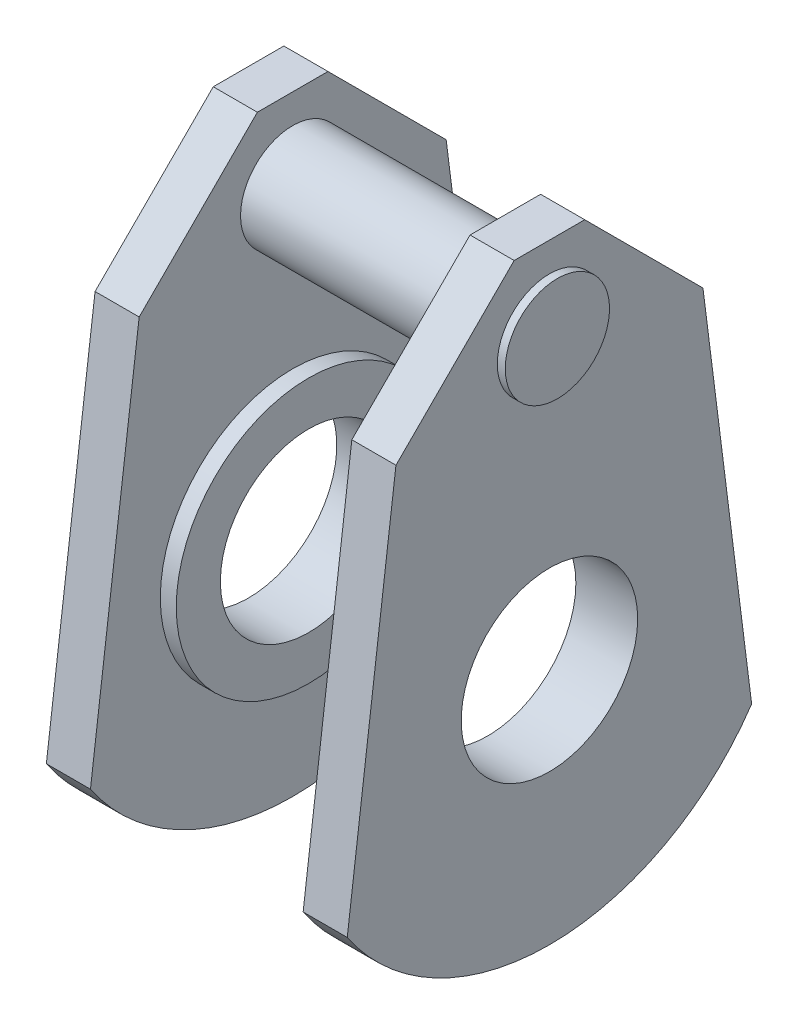
ISO-10303-21;
HEADER;
FILE_DESCRIPTION(('STEP AP214'),'2;1');
FILE_NAME('part.step','',(''),(''),'','','');
FILE_SCHEMA(('AUTOMOTIVE_DESIGN { 1 0 10303 214 1 1 1 1 }'));
ENDSEC;
DATA;
#1=APPLICATION_CONTEXT('core data for automotive mechanical design processes');
#2=APPLICATION_PROTOCOL_DEFINITION('international standard','automotive_design',2000,#1);
#3=PRODUCT_CONTEXT('',#1,'mechanical');
#4=PRODUCT('Part','Part','',(#3));
#5=PRODUCT_RELATED_PRODUCT_CATEGORY('part','',(#4));
#6=PRODUCT_DEFINITION_FORMATION('','',#4);
#7=PRODUCT_DEFINITION_CONTEXT('part definition',#1,'design');
#8=PRODUCT_DEFINITION('design','',#6,#7);
#9=PRODUCT_DEFINITION_SHAPE('','',#8);
#10=(LENGTH_UNIT() NAMED_UNIT(*) SI_UNIT(.MILLI.,.METRE.));
#11=(NAMED_UNIT(*) PLANE_ANGLE_UNIT() SI_UNIT($,.RADIAN.));
#12=(NAMED_UNIT(*) SI_UNIT($,.STERADIAN.) SOLID_ANGLE_UNIT());
#13=UNCERTAINTY_MEASURE_WITH_UNIT(LENGTH_MEASURE(1.E-05),#10,'distance_accuracy_value','');
#14=(GEOMETRIC_REPRESENTATION_CONTEXT(3) GLOBAL_UNCERTAINTY_ASSIGNED_CONTEXT((#13)) GLOBAL_UNIT_ASSIGNED_CONTEXT((#10,
#11,#12)) REPRESENTATION_CONTEXT('',''));
#15=CARTESIAN_POINT('',(0.,0.,0.));
#16=DIRECTION('',(0.,0.,1.));
#17=DIRECTION('',(1.,0.,0.));
#18=AXIS2_PLACEMENT_3D('',#15,#16,#17);
#19=CARTESIAN_POINT('',(12.05,0.,0.));
#20=DIRECTION('',(-1.,0.,0.));
#21=DIRECTION('',(0.,0.,1.));
#22=AXIS2_PLACEMENT_3D('',#19,#20,#21);
#23=CYLINDRICAL_SURFACE('',#22,15.);
#24=CARTESIAN_POINT('',(-10.2435826136185,0.,0.));
#25=DIRECTION('',(-1.,0.,0.));
#26=DIRECTION('',(0.,0.,1.));
#27=AXIS2_PLACEMENT_3D('',#24,#25,#26);
#28=CIRCLE('',#27,15.);
#29=CARTESIAN_POINT('',(-10.2435826136185,0.,15.));
#30=VERTEX_POINT('',#29);
#31=EDGE_CURVE('E206',#30,#30,#28,.T.);
#32=ORIENTED_EDGE('',*,*,#31,.T.);
#33=EDGE_LOOP('',(#32));
#34=FACE_BOUND('',#33,.T.);
#35=CARTESIAN_POINT('',(-12.05,0.,0.));
#36=DIRECTION('',(-1.,0.,0.));
#37=DIRECTION('',(0.,0.,1.));
#38=AXIS2_PLACEMENT_3D('',#35,#36,#37);
#39=CIRCLE('',#38,15.);
#40=CARTESIAN_POINT('',(-12.05,0.,15.));
#41=VERTEX_POINT('',#40);
#42=EDGE_CURVE('E184',#41,#41,#39,.T.);
#43=ORIENTED_EDGE('',*,*,#42,.F.);
#44=EDGE_LOOP('',(#43));
#45=FACE_BOUND('',#44,.T.);
#46=ADVANCED_FACE('F51',(#34,#45),#23,.T.);
#47=CARTESIAN_POINT('',(12.05,0.,0.));
#48=DIRECTION('',(-1.,0.,0.));
#49=DIRECTION('',(0.,0.,1.));
#50=AXIS2_PLACEMENT_3D('',#47,#48,#49);
#51=CYLINDRICAL_SURFACE('',#50,10.);
#52=CARTESIAN_POINT('',(-10.2435826136185,0.,0.));
#53=DIRECTION('',(-1.,0.,0.));
#54=DIRECTION('',(0.,0.,1.));
#55=AXIS2_PLACEMENT_3D('',#52,#53,#54);
#56=CIRCLE('',#55,10.);
#57=CARTESIAN_POINT('',(-10.2435826136185,0.,10.));
#58=VERTEX_POINT('',#57);
#59=EDGE_CURVE('E55',#58,#58,#56,.T.);
#60=ORIENTED_EDGE('',*,*,#59,.F.);
#61=EDGE_LOOP('',(#60));
#62=FACE_BOUND('',#61,.T.);
#63=CARTESIAN_POINT('',(-17.05,0.,0.));
#64=DIRECTION('',(-1.,0.,0.));
#65=DIRECTION('',(0.,0.,1.));
#66=AXIS2_PLACEMENT_3D('',#63,#64,#65);
#67=CIRCLE('',#66,10.);
#68=CARTESIAN_POINT('',(-17.05,0.,10.));
#69=VERTEX_POINT('',#68);
#70=EDGE_CURVE('E296',#69,#69,#67,.T.);
#71=ORIENTED_EDGE('',*,*,#70,.T.);
#72=EDGE_LOOP('',(#71));
#73=FACE_BOUND('',#72,.T.);
#74=ADVANCED_FACE('F332',(#62,#73),#51,.F.);
#75=CARTESIAN_POINT('',(10.0426560530877,0.,0.));
#76=DIRECTION('',(1.,0.,0.));
#77=DIRECTION('',(0.,0.,-1.));
#78=AXIS2_PLACEMENT_3D('',#75,#76,#77);
#79=CIRCLE('',#78,15.);
#80=CARTESIAN_POINT('',(10.0426560530877,0.,-15.));
#81=VERTEX_POINT('',#80);
#82=EDGE_CURVE('E196',#81,#81,#79,.T.);
#83=ORIENTED_EDGE('',*,*,#82,.T.);
#84=EDGE_LOOP('',(#83));
#85=FACE_BOUND('',#84,.T.);
#86=CARTESIAN_POINT('',(12.05,0.,0.));
#87=DIRECTION('',(1.,0.,0.));
#88=DIRECTION('',(0.,0.,-1.));
#89=AXIS2_PLACEMENT_3D('',#86,#87,#88);
#90=CIRCLE('',#89,15.);
#91=CARTESIAN_POINT('',(12.05,0.,-15.));
#92=VERTEX_POINT('',#91);
#93=EDGE_CURVE('E180',#92,#92,#90,.T.);
#94=ORIENTED_EDGE('',*,*,#93,.F.);
#95=EDGE_LOOP('',(#94));
#96=FACE_BOUND('',#95,.T.);
#97=ADVANCED_FACE('F53',(#85,#96),#23,.T.);
#98=CARTESIAN_POINT('',(10.0426560530877,0.,0.));
#99=DIRECTION('',(1.,0.,0.));
#100=DIRECTION('',(0.,0.,-1.));
#101=AXIS2_PLACEMENT_3D('',#98,#99,#100);
#102=CIRCLE('',#101,10.);
#103=CARTESIAN_POINT('',(10.0426560530877,0.,-10.));
#104=VERTEX_POINT('',#103);
#105=EDGE_CURVE('E193',#104,#104,#102,.T.);
#106=ORIENTED_EDGE('',*,*,#105,.F.);
#107=EDGE_LOOP('',(#106));
#108=FACE_BOUND('',#107,.T.);
#109=CARTESIAN_POINT('',(17.05,0.,0.));
#110=DIRECTION('',(1.,0.,0.));
#111=DIRECTION('',(0.,0.,-1.));
#112=AXIS2_PLACEMENT_3D('',#109,#110,#111);
#113=CIRCLE('',#112,10.);
#114=CARTESIAN_POINT('',(17.05,0.,-10.));
#115=VERTEX_POINT('',#114);
#116=EDGE_CURVE('E154',#115,#115,#113,.T.);
#117=ORIENTED_EDGE('',*,*,#116,.T.);
#118=EDGE_LOOP('',(#117));
#119=FACE_BOUND('',#118,.T.);
#120=ADVANCED_FACE('F339',(#108,#119),#51,.F.);
#121=CARTESIAN_POINT('',(17.05,0.647332808915461,0.));
#122=DIRECTION('',(1.,0.,0.));
#123=DIRECTION('',(0.,0.,-1.));
#124=AXIS2_PLACEMENT_3D('',#121,#122,#123);
#125=PLANE('',#124);
#126=CARTESIAN_POINT('',(17.05,32.9574193594756,0.));
#127=DIRECTION('',(1.,0.,0.));
#128=DIRECTION('',(0.,0.,-1.));
#129=AXIS2_PLACEMENT_3D('',#126,#127,#128);
#130=CIRCLE('',#129,5.90701498138917);
#131=CARTESIAN_POINT('',(17.05,32.9574193594756,-5.90701498138917));
#132=VERTEX_POINT('',#131);
#133=EDGE_CURVE('E12',#132,#132,#130,.T.);
#134=ORIENTED_EDGE('',*,*,#133,.F.);
#135=EDGE_LOOP('',(#134));
#136=FACE_BOUND('',#135,.T.);
#137=DIRECTION('',(0.,0.707106781186554,0.707106781186541));
#138=VECTOR('',#137,1.);
#139=CARTESIAN_POINT('',(17.05,42.1768709505272,-4.));
#140=LINE('',#139,#138);
#141=CARTESIAN_POINT('',(17.05,28.7813158914375,-17.3955550590895));
#142=VERTEX_POINT('',#141);
#143=CARTESIAN_POINT('',(17.05,42.1768709505272,-4.));
#144=VERTEX_POINT('',#143);
#145=EDGE_CURVE('E166',#142,#144,#140,.T.);
#146=ORIENTED_EDGE('',*,*,#145,.T.);
#147=DIRECTION('',(0.,0.,1.));
#148=VECTOR('',#147,1.);
#149=CARTESIAN_POINT('',(17.05,42.1768709505272,4.));
#150=LINE('',#149,#148);
#151=CARTESIAN_POINT('',(17.05,42.1768709505272,4.));
#152=VERTEX_POINT('',#151);
#153=EDGE_CURVE('E110',#144,#152,#150,.T.);
#154=ORIENTED_EDGE('',*,*,#153,.T.);
#155=DIRECTION('',(0.,-0.707106781186554,0.707106781186541));
#156=VECTOR('',#155,1.);
#157=CARTESIAN_POINT('',(17.05,42.1768709505272,4.));
#158=LINE('',#157,#156);
#159=CARTESIAN_POINT('',(17.05,28.7813158914375,17.3955550590895));
#160=VERTEX_POINT('',#159);
#161=EDGE_CURVE('E127',#152,#160,#158,.T.);
#162=ORIENTED_EDGE('',*,*,#161,.T.);
#163=DIRECTION('',(0.,-0.992078684734191,0.125618005461308));
#164=VECTOR('',#163,1.);
#165=CARTESIAN_POINT('',(17.05,28.7813158914375,17.3955550590895));
#166=LINE('',#165,#164);
#167=CARTESIAN_POINT('',(17.05,-14.8052566903872,22.9145309194471));
#168=VERTEX_POINT('',#167);
#169=EDGE_CURVE('E120',#160,#168,#166,.T.);
#170=ORIENTED_EDGE('',*,*,#169,.T.);
#171=CARTESIAN_POINT('',(17.05,0.647332808915461,0.));
#172=DIRECTION('',(1.,0.,0.));
#173=DIRECTION('',(0.,0.,-1.));
#174=AXIS2_PLACEMENT_3D('',#171,#172,#173);
#175=CIRCLE('',#174,27.6379856265296);
#176=CARTESIAN_POINT('',(17.05,-14.8052566903872,-22.9145309194471));
#177=VERTEX_POINT('',#176);
#178=EDGE_CURVE('E125',#168,#177,#175,.T.);
#179=ORIENTED_EDGE('',*,*,#178,.T.);
#180=DIRECTION('',(0.,0.992078684734191,0.125618005461308));
#181=VECTOR('',#180,1.);
#182=CARTESIAN_POINT('',(17.05,28.7813158914375,-17.3955550590895));
#183=LINE('',#182,#181);
#184=EDGE_CURVE('E71',#177,#142,#183,.T.);
#185=ORIENTED_EDGE('',*,*,#184,.T.);
#186=EDGE_LOOP('',(#146,#154,#162,#170,#179,#185));
#187=FACE_BOUND('',#186,.T.);
#188=ORIENTED_EDGE('',*,*,#116,.F.);
#189=EDGE_LOOP('',(#188));
#190=FACE_BOUND('',#189,.T.);
#191=ADVANCED_FACE('F122',(#136,#187,#190),#125,.T.);
#192=CARTESIAN_POINT('',(12.05,0.647332808915461,0.));
#193=DIRECTION('',(1.,0.,0.));
#194=DIRECTION('',(0.,0.,-1.));
#195=AXIS2_PLACEMENT_3D('',#192,#193,#194);
#196=PLANE('',#195);
#197=CARTESIAN_POINT('',(12.05,32.9574193594756,0.));
#198=DIRECTION('',(1.,0.,0.));
#199=DIRECTION('',(0.,0.,-1.));
#200=AXIS2_PLACEMENT_3D('',#197,#198,#199);
#201=CIRCLE('',#200,5.90701498138917);
#202=CARTESIAN_POINT('',(12.05,32.9574193594756,-5.90701498138917));
#203=VERTEX_POINT('',#202);
#204=EDGE_CURVE('E191',#203,#203,#201,.T.);
#205=ORIENTED_EDGE('',*,*,#204,.T.);
#206=EDGE_LOOP('',(#205));
#207=FACE_BOUND('',#206,.T.);
#208=ORIENTED_EDGE('',*,*,#93,.T.);
#209=EDGE_LOOP('',(#208));
#210=FACE_BOUND('',#209,.T.);
#211=DIRECTION('',(0.,0.707106781186554,0.707106781186541));
#212=VECTOR('',#211,1.);
#213=CARTESIAN_POINT('',(12.05,42.1768709505272,-4.));
#214=LINE('',#213,#212);
#215=CARTESIAN_POINT('',(12.05,28.7813158914375,-17.3955550590895));
#216=VERTEX_POINT('',#215);
#217=CARTESIAN_POINT('',(12.05,42.1768709505272,-4.));
#218=VERTEX_POINT('',#217);
#219=EDGE_CURVE('E149',#216,#218,#214,.T.);
#220=ORIENTED_EDGE('',*,*,#219,.F.);
#221=DIRECTION('',(0.,0.992078684734191,0.125618005461308));
#222=VECTOR('',#221,1.);
#223=CARTESIAN_POINT('',(12.05,28.7813158914375,-17.3955550590895));
#224=LINE('',#223,#222);
#225=CARTESIAN_POINT('',(12.05,-14.8052566903872,-22.9145309194471));
#226=VERTEX_POINT('',#225);
#227=EDGE_CURVE('E101',#226,#216,#224,.T.);
#228=ORIENTED_EDGE('',*,*,#227,.F.);
#229=CARTESIAN_POINT('',(12.05,0.647332808915461,0.));
#230=DIRECTION('',(1.,0.,0.));
#231=DIRECTION('',(0.,0.,-1.));
#232=AXIS2_PLACEMENT_3D('',#229,#230,#231);
#233=CIRCLE('',#232,27.6379856265296);
#234=CARTESIAN_POINT('',(12.05,-14.8052566903872,22.9145309194471));
#235=VERTEX_POINT('',#234);
#236=EDGE_CURVE('E95',#235,#226,#233,.T.);
#237=ORIENTED_EDGE('',*,*,#236,.F.);
#238=DIRECTION('',(0.,-0.992078684734191,0.125618005461308));
#239=VECTOR('',#238,1.);
#240=CARTESIAN_POINT('',(12.05,28.7813158914375,17.3955550590895));
#241=LINE('',#240,#239);
#242=CARTESIAN_POINT('',(12.05,28.7813158914375,17.3955550590895));
#243=VERTEX_POINT('',#242);
#244=EDGE_CURVE('E136',#243,#235,#241,.T.);
#245=ORIENTED_EDGE('',*,*,#244,.F.);
#246=DIRECTION('',(0.,-0.707106781186554,0.707106781186541));
#247=VECTOR('',#246,1.);
#248=CARTESIAN_POINT('',(12.05,42.1768709505272,4.));
#249=LINE('',#248,#247);
#250=CARTESIAN_POINT('',(12.05,42.1768709505272,4.));
#251=VERTEX_POINT('',#250);
#252=EDGE_CURVE('E157',#251,#243,#249,.T.);
#253=ORIENTED_EDGE('',*,*,#252,.F.);
#254=DIRECTION('',(0.,0.,1.));
#255=VECTOR('',#254,1.);
#256=CARTESIAN_POINT('',(12.05,42.1768709505272,4.));
#257=LINE('',#256,#255);
#258=EDGE_CURVE('E153',#218,#251,#257,.T.);
#259=ORIENTED_EDGE('',*,*,#258,.F.);
#260=EDGE_LOOP('',(#220,#228,#237,#245,#253,#259));
#261=FACE_BOUND('',#260,.T.);
#262=ADVANCED_FACE('F315',(#207,#210,#261),#196,.F.);
#263=CARTESIAN_POINT('',(17.05,42.1768709505272,-4.));
#264=DIRECTION('',(0.,-0.707106781186541,0.707106781186554));
#265=DIRECTION('',(0.,-0.707106781186554,-0.707106781186541));
#266=AXIS2_PLACEMENT_3D('',#263,#264,#265);
#267=PLANE('',#266);
#268=ORIENTED_EDGE('',*,*,#219,.T.);
#269=DIRECTION('',(-1.,0.,0.));
#270=VECTOR('',#269,1.);
#271=CARTESIAN_POINT('',(17.05,42.1768709505272,-4.));
#272=LINE('',#271,#270);
#273=EDGE_CURVE('E177',#144,#218,#272,.T.);
#274=ORIENTED_EDGE('',*,*,#273,.F.);
#275=ORIENTED_EDGE('',*,*,#145,.F.);
#276=DIRECTION('',(-1.,0.,0.));
#277=VECTOR('',#276,1.);
#278=CARTESIAN_POINT('',(17.05,28.7813158914375,-17.3955550590895));
#279=LINE('',#278,#277);
#280=EDGE_CURVE('E145',#142,#216,#279,.T.);
#281=ORIENTED_EDGE('',*,*,#280,.T.);
#282=EDGE_LOOP('',(#268,#274,#275,#281));
#283=FACE_BOUND('',#282,.T.);
#284=ADVANCED_FACE('F317',(#283),#267,.F.);
#285=CARTESIAN_POINT('',(17.05,42.1768709505272,4.));
#286=DIRECTION('',(0.,-1.,0.));
#287=DIRECTION('',(0.,0.,-1.));
#288=AXIS2_PLACEMENT_3D('',#285,#286,#287);
#289=PLANE('',#288);
#290=ORIENTED_EDGE('',*,*,#258,.T.);
#291=DIRECTION('',(-1.,0.,0.));
#292=VECTOR('',#291,1.);
#293=CARTESIAN_POINT('',(17.05,42.1768709505272,4.));
#294=LINE('',#293,#292);
#295=EDGE_CURVE('E173',#152,#251,#294,.T.);
#296=ORIENTED_EDGE('',*,*,#295,.F.);
#297=ORIENTED_EDGE('',*,*,#153,.F.);
#298=ORIENTED_EDGE('',*,*,#273,.T.);
#299=EDGE_LOOP('',(#290,#296,#297,#298));
#300=FACE_BOUND('',#299,.T.);
#301=ADVANCED_FACE('F309',(#300),#289,.F.);
#302=CARTESIAN_POINT('',(17.05,42.1768709505272,4.));
#303=DIRECTION('',(0.,-0.707106781186541,-0.707106781186554));
#304=DIRECTION('',(0.,0.707106781186554,-0.707106781186541));
#305=AXIS2_PLACEMENT_3D('',#302,#303,#304);
#306=PLANE('',#305);
#307=ORIENTED_EDGE('',*,*,#252,.T.);
#308=DIRECTION('',(-1.,0.,0.));
#309=VECTOR('',#308,1.);
#310=CARTESIAN_POINT('',(17.05,28.7813158914375,17.3955550590895));
#311=LINE('',#310,#309);
#312=EDGE_CURVE('E138',#160,#243,#311,.T.);
#313=ORIENTED_EDGE('',*,*,#312,.F.);
#314=ORIENTED_EDGE('',*,*,#161,.F.);
#315=ORIENTED_EDGE('',*,*,#295,.T.);
#316=EDGE_LOOP('',(#307,#313,#314,#315));
#317=FACE_BOUND('',#316,.T.);
#318=ADVANCED_FACE('F312',(#317),#306,.F.);
#319=CARTESIAN_POINT('',(17.05,28.7813158914375,17.3955550590895));
#320=DIRECTION('',(0.,-0.125618005461308,-0.992078684734191));
#321=DIRECTION('',(0.,0.992078684734191,-0.125618005461308));
#322=AXIS2_PLACEMENT_3D('',#319,#320,#321);
#323=PLANE('',#322);
#324=ORIENTED_EDGE('',*,*,#244,.T.);
#325=DIRECTION('',(-1.,0.,0.));
#326=VECTOR('',#325,1.);
#327=CARTESIAN_POINT('',(17.05,-14.8052566903872,22.9145309194471));
#328=LINE('',#327,#326);
#329=EDGE_CURVE('E133',#168,#235,#328,.T.);
#330=ORIENTED_EDGE('',*,*,#329,.F.);
#331=ORIENTED_EDGE('',*,*,#169,.F.);
#332=ORIENTED_EDGE('',*,*,#312,.T.);
#333=EDGE_LOOP('',(#324,#330,#331,#332));
#334=FACE_BOUND('',#333,.T.);
#335=ADVANCED_FACE('F134',(#334),#323,.F.);
#336=CARTESIAN_POINT('',(17.05,0.647332808915461,0.));
#337=DIRECTION('',(-1.,0.,0.));
#338=DIRECTION('',(0.,0.,1.));
#339=AXIS2_PLACEMENT_3D('',#336,#337,#338);
#340=CYLINDRICAL_SURFACE('',#339,27.6379856265296);
#341=ORIENTED_EDGE('',*,*,#236,.T.);
#342=DIRECTION('',(-1.,0.,0.));
#343=VECTOR('',#342,1.);
#344=CARTESIAN_POINT('',(17.05,-14.8052566903872,-22.9145309194471));
#345=LINE('',#344,#343);
#346=EDGE_CURVE('E139',#177,#226,#345,.T.);
#347=ORIENTED_EDGE('',*,*,#346,.F.);
#348=ORIENTED_EDGE('',*,*,#178,.F.);
#349=ORIENTED_EDGE('',*,*,#329,.T.);
#350=EDGE_LOOP('',(#341,#347,#348,#349));
#351=FACE_BOUND('',#350,.T.);
#352=ADVANCED_FACE('F141',(#351),#340,.T.);
#353=CARTESIAN_POINT('',(17.05,28.7813158914375,-17.3955550590895));
#354=DIRECTION('',(0.,-0.125618005461308,0.992078684734191));
#355=DIRECTION('',(0.,-0.992078684734191,-0.125618005461308));
#356=AXIS2_PLACEMENT_3D('',#353,#354,#355);
#357=PLANE('',#356);
#358=ORIENTED_EDGE('',*,*,#227,.T.);
#359=ORIENTED_EDGE('',*,*,#280,.F.);
#360=ORIENTED_EDGE('',*,*,#184,.F.);
#361=ORIENTED_EDGE('',*,*,#346,.T.);
#362=EDGE_LOOP('',(#358,#359,#360,#361));
#363=FACE_BOUND('',#362,.T.);
#364=ADVANCED_FACE('F318',(#363),#357,.F.);
#365=CARTESIAN_POINT('',(-17.05,0.,0.));
#366=DIRECTION('',(-1.,0.,0.));
#367=DIRECTION('',(0.,0.,1.));
#368=AXIS2_PLACEMENT_3D('',#365,#366,#367);
#369=PLANE('',#368);
#370=CARTESIAN_POINT('',(-17.05,32.9574193594756,0.));
#371=DIRECTION('',(-1.,0.,0.));
#372=DIRECTION('',(0.,0.,1.));
#373=AXIS2_PLACEMENT_3D('',#370,#371,#372);
#374=CIRCLE('',#373,5.90701498138917);
#375=CARTESIAN_POINT('',(-17.05,32.9574193594756,5.90701498138917));
#376=VERTEX_POINT('',#375);
#377=EDGE_CURVE('E62',#376,#376,#374,.T.);
#378=ORIENTED_EDGE('',*,*,#377,.F.);
#379=EDGE_LOOP('',(#378));
#380=FACE_BOUND('',#379,.T.);
#381=ORIENTED_EDGE('',*,*,#70,.F.);
#382=EDGE_LOOP('',(#381));
#383=FACE_BOUND('',#382,.T.);
#384=DIRECTION('',(0.,-0.707106781186554,-0.707106781186541));
#385=VECTOR('',#384,1.);
#386=CARTESIAN_POINT('',(-17.05,28.7813158914375,-17.3955550590895));
#387=LINE('',#386,#385);
#388=CARTESIAN_POINT('',(-17.05,42.1768709505272,-4.));
#389=VERTEX_POINT('',#388);
#390=CARTESIAN_POINT('',(-17.05,28.7813158914375,-17.3955550590895));
#391=VERTEX_POINT('',#390);
#392=EDGE_CURVE('E225',#389,#391,#387,.T.);
#393=ORIENTED_EDGE('',*,*,#392,.T.);
#394=DIRECTION('',(0.,-0.992078684734191,-0.125618005461308));
#395=VECTOR('',#394,1.);
#396=CARTESIAN_POINT('',(-17.05,-14.8052566903872,-22.9145309194471));
#397=LINE('',#396,#395);
#398=CARTESIAN_POINT('',(-17.05,-14.8052566903872,-22.9145309194471));
#399=VERTEX_POINT('',#398);
#400=EDGE_CURVE('E229',#391,#399,#397,.T.);
#401=ORIENTED_EDGE('',*,*,#400,.T.);
#402=CARTESIAN_POINT('',(-17.05,0.647332808915461,0.));
#403=DIRECTION('',(-1.,0.,0.));
#404=DIRECTION('',(0.,0.,1.));
#405=AXIS2_PLACEMENT_3D('',#402,#403,#404);
#406=CIRCLE('',#405,27.6379856265296);
#407=CARTESIAN_POINT('',(-17.05,-14.8052566903872,22.9145309194471));
#408=VERTEX_POINT('',#407);
#409=EDGE_CURVE('E234',#399,#408,#406,.T.);
#410=ORIENTED_EDGE('',*,*,#409,.T.);
#411=DIRECTION('',(0.,0.992078684734191,-0.125618005461308));
#412=VECTOR('',#411,1.);
#413=CARTESIAN_POINT('',(-17.05,28.7813158914375,17.3955550590895));
#414=LINE('',#413,#412);
#415=CARTESIAN_POINT('',(-17.05,28.7813158914375,17.3955550590895));
#416=VERTEX_POINT('',#415);
#417=EDGE_CURVE('E238',#408,#416,#414,.T.);
#418=ORIENTED_EDGE('',*,*,#417,.T.);
#419=DIRECTION('',(0.,0.707106781186554,-0.707106781186541));
#420=VECTOR('',#419,1.);
#421=CARTESIAN_POINT('',(-17.05,42.1768709505272,4.));
#422=LINE('',#421,#420);
#423=CARTESIAN_POINT('',(-17.05,42.1768709505272,4.));
#424=VERTEX_POINT('',#423);
#425=EDGE_CURVE('E242',#416,#424,#422,.T.);
#426=ORIENTED_EDGE('',*,*,#425,.T.);
#427=DIRECTION('',(0.,0.,-1.));
#428=VECTOR('',#427,1.);
#429=CARTESIAN_POINT('',(-17.05,42.1768709505272,-4.));
#430=LINE('',#429,#428);
#431=EDGE_CURVE('E246',#424,#389,#430,.T.);
#432=ORIENTED_EDGE('',*,*,#431,.T.);
#433=EDGE_LOOP('',(#393,#401,#410,#418,#426,#432));
#434=FACE_BOUND('',#433,.T.);
#435=ADVANCED_FACE('F320',(#380,#383,#434),#369,.T.);
#436=CARTESIAN_POINT('',(-12.05,0.647332808915461,0.));
#437=DIRECTION('',(-1.,0.,0.));
#438=DIRECTION('',(0.,0.,1.));
#439=AXIS2_PLACEMENT_3D('',#436,#437,#438);
#440=PLANE('',#439);
#441=CARTESIAN_POINT('',(-12.05,32.9574193594756,0.));
#442=DIRECTION('',(-1.,0.,0.));
#443=DIRECTION('',(0.,0.,1.));
#444=AXIS2_PLACEMENT_3D('',#441,#442,#443);
#445=CIRCLE('',#444,5.90701498138917);
#446=CARTESIAN_POINT('',(-12.05,32.9574193594756,5.90701498138917));
#447=VERTEX_POINT('',#446);
#448=EDGE_CURVE('E188',#447,#447,#445,.T.);
#449=ORIENTED_EDGE('',*,*,#448,.T.);
#450=EDGE_LOOP('',(#449));
#451=FACE_BOUND('',#450,.T.);
#452=DIRECTION('',(0.,-0.707106781186554,-0.707106781186541));
#453=VECTOR('',#452,1.);
#454=CARTESIAN_POINT('',(-12.05,28.7813158914375,-17.3955550590895));
#455=LINE('',#454,#453);
#456=CARTESIAN_POINT('',(-12.05,42.1768709505272,-4.));
#457=VERTEX_POINT('',#456);
#458=CARTESIAN_POINT('',(-12.05,28.7813158914375,-17.3955550590895));
#459=VERTEX_POINT('',#458);
#460=EDGE_CURVE('E223',#457,#459,#455,.T.);
#461=ORIENTED_EDGE('',*,*,#460,.F.);
#462=DIRECTION('',(0.,0.,-1.));
#463=VECTOR('',#462,1.);
#464=CARTESIAN_POINT('',(-12.05,42.1768709505272,-4.));
#465=LINE('',#464,#463);
#466=CARTESIAN_POINT('',(-12.05,42.1768709505272,4.));
#467=VERTEX_POINT('',#466);
#468=EDGE_CURVE('E230',#467,#457,#465,.T.);
#469=ORIENTED_EDGE('',*,*,#468,.F.);
#470=DIRECTION('',(0.,0.707106781186554,-0.707106781186541));
#471=VECTOR('',#470,1.);
#472=CARTESIAN_POINT('',(-12.05,42.1768709505272,4.));
#473=LINE('',#472,#471);
#474=CARTESIAN_POINT('',(-12.05,28.7813158914375,17.3955550590895));
#475=VERTEX_POINT('',#474);
#476=EDGE_CURVE('E266',#475,#467,#473,.T.);
#477=ORIENTED_EDGE('',*,*,#476,.F.);
#478=DIRECTION('',(0.,0.992078684734191,-0.125618005461308));
#479=VECTOR('',#478,1.);
#480=CARTESIAN_POINT('',(-12.05,28.7813158914375,17.3955550590895));
#481=LINE('',#480,#479);
#482=CARTESIAN_POINT('',(-12.05,-14.8052566903872,22.9145309194471));
#483=VERTEX_POINT('',#482);
#484=EDGE_CURVE('E262',#483,#475,#481,.T.);
#485=ORIENTED_EDGE('',*,*,#484,.F.);
#486=CARTESIAN_POINT('',(-12.05,0.647332808915461,0.));
#487=DIRECTION('',(-1.,0.,0.));
#488=DIRECTION('',(0.,0.,1.));
#489=AXIS2_PLACEMENT_3D('',#486,#487,#488);
#490=CIRCLE('',#489,27.6379856265296);
#491=CARTESIAN_POINT('',(-12.05,-14.8052566903872,-22.9145309194471));
#492=VERTEX_POINT('',#491);
#493=EDGE_CURVE('E258',#492,#483,#490,.T.);
#494=ORIENTED_EDGE('',*,*,#493,.F.);
#495=DIRECTION('',(0.,-0.992078684734191,-0.125618005461308));
#496=VECTOR('',#495,1.);
#497=CARTESIAN_POINT('',(-12.05,-14.8052566903872,-22.9145309194471));
#498=LINE('',#497,#496);
#499=EDGE_CURVE('E254',#459,#492,#498,.T.);
#500=ORIENTED_EDGE('',*,*,#499,.F.);
#501=EDGE_LOOP('',(#461,#469,#477,#485,#494,#500));
#502=FACE_BOUND('',#501,.T.);
#503=ORIENTED_EDGE('',*,*,#42,.T.);
#504=EDGE_LOOP('',(#503));
#505=FACE_BOUND('',#504,.T.);
#506=ADVANCED_FACE('F326',(#451,#502,#505),#440,.F.);
#507=CARTESIAN_POINT('',(-17.05,28.7813158914375,-17.3955550590895));
#508=DIRECTION('',(0.,-0.707106781186541,0.707106781186554));
#509=DIRECTION('',(0.,-0.707106781186554,-0.707106781186541));
#510=AXIS2_PLACEMENT_3D('',#507,#508,#509);
#511=PLANE('',#510);
#512=ORIENTED_EDGE('',*,*,#460,.T.);
#513=DIRECTION('',(1.,0.,0.));
#514=VECTOR('',#513,1.);
#515=CARTESIAN_POINT('',(-17.05,28.7813158914375,-17.3955550590895));
#516=LINE('',#515,#514);
#517=EDGE_CURVE('E292',#391,#459,#516,.T.);
#518=ORIENTED_EDGE('',*,*,#517,.F.);
#519=ORIENTED_EDGE('',*,*,#392,.F.);
#520=DIRECTION('',(1.,0.,0.));
#521=VECTOR('',#520,1.);
#522=CARTESIAN_POINT('',(-17.05,42.1768709505272,-4.));
#523=LINE('',#522,#521);
#524=EDGE_CURVE('E250',#389,#457,#523,.T.);
#525=ORIENTED_EDGE('',*,*,#524,.T.);
#526=EDGE_LOOP('',(#512,#518,#519,#525));
#527=FACE_BOUND('',#526,.T.);
#528=ADVANCED_FACE('F359',(#527),#511,.F.);
#529=CARTESIAN_POINT('',(-17.05,-14.8052566903872,-22.9145309194471));
#530=DIRECTION('',(0.,-0.125618005461308,0.992078684734191));
#531=DIRECTION('',(0.,-0.992078684734191,-0.125618005461308));
#532=AXIS2_PLACEMENT_3D('',#529,#530,#531);
#533=PLANE('',#532);
#534=ORIENTED_EDGE('',*,*,#499,.T.);
#535=DIRECTION('',(1.,0.,0.));
#536=VECTOR('',#535,1.);
#537=CARTESIAN_POINT('',(-17.05,-14.8052566903872,-22.9145309194471));
#538=LINE('',#537,#536);
#539=EDGE_CURVE('E288',#399,#492,#538,.T.);
#540=ORIENTED_EDGE('',*,*,#539,.F.);
#541=ORIENTED_EDGE('',*,*,#400,.F.);
#542=ORIENTED_EDGE('',*,*,#517,.T.);
#543=EDGE_LOOP('',(#534,#540,#541,#542));
#544=FACE_BOUND('',#543,.T.);
#545=ADVANCED_FACE('F362',(#544),#533,.F.);
#546=CARTESIAN_POINT('',(-17.05,0.647332808915461,0.));
#547=DIRECTION('',(1.,0.,0.));
#548=DIRECTION('',(0.,0.,-1.));
#549=AXIS2_PLACEMENT_3D('',#546,#547,#548);
#550=CYLINDRICAL_SURFACE('',#549,27.6379856265296);
#551=ORIENTED_EDGE('',*,*,#493,.T.);
#552=DIRECTION('',(1.,0.,0.));
#553=VECTOR('',#552,1.);
#554=CARTESIAN_POINT('',(-17.05,-14.8052566903872,22.9145309194471));
#555=LINE('',#554,#553);
#556=EDGE_CURVE('E284',#408,#483,#555,.T.);
#557=ORIENTED_EDGE('',*,*,#556,.F.);
#558=ORIENTED_EDGE('',*,*,#409,.F.);
#559=ORIENTED_EDGE('',*,*,#539,.T.);
#560=EDGE_LOOP('',(#551,#557,#558,#559));
#561=FACE_BOUND('',#560,.T.);
#562=ADVANCED_FACE('F366',(#561),#550,.T.);
#563=CARTESIAN_POINT('',(-17.05,28.7813158914375,17.3955550590895));
#564=DIRECTION('',(0.,-0.125618005461308,-0.992078684734191));
#565=DIRECTION('',(0.,0.992078684734191,-0.125618005461308));
#566=AXIS2_PLACEMENT_3D('',#563,#564,#565);
#567=PLANE('',#566);
#568=ORIENTED_EDGE('',*,*,#484,.T.);
#569=DIRECTION('',(1.,0.,0.));
#570=VECTOR('',#569,1.);
#571=CARTESIAN_POINT('',(-17.05,28.7813158914375,17.3955550590895));
#572=LINE('',#571,#570);
#573=EDGE_CURVE('E280',#416,#475,#572,.T.);
#574=ORIENTED_EDGE('',*,*,#573,.F.);
#575=ORIENTED_EDGE('',*,*,#417,.F.);
#576=ORIENTED_EDGE('',*,*,#556,.T.);
#577=EDGE_LOOP('',(#568,#574,#575,#576));
#578=FACE_BOUND('',#577,.T.);
#579=ADVANCED_FACE('F370',(#578),#567,.F.);
#580=CARTESIAN_POINT('',(-17.05,42.1768709505272,4.));
#581=DIRECTION('',(0.,-0.707106781186541,-0.707106781186554));
#582=DIRECTION('',(0.,0.707106781186554,-0.707106781186541));
#583=AXIS2_PLACEMENT_3D('',#580,#581,#582);
#584=PLANE('',#583);
#585=ORIENTED_EDGE('',*,*,#476,.T.);
#586=DIRECTION('',(1.,0.,0.));
#587=VECTOR('',#586,1.);
#588=CARTESIAN_POINT('',(-17.05,42.1768709505272,4.));
#589=LINE('',#588,#587);
#590=EDGE_CURVE('E276',#424,#467,#589,.T.);
#591=ORIENTED_EDGE('',*,*,#590,.F.);
#592=ORIENTED_EDGE('',*,*,#425,.F.);
#593=ORIENTED_EDGE('',*,*,#573,.T.);
#594=EDGE_LOOP('',(#585,#591,#592,#593));
#595=FACE_BOUND('',#594,.T.);
#596=ADVANCED_FACE('F374',(#595),#584,.F.);
#597=CARTESIAN_POINT('',(-17.05,42.1768709505272,-4.));
#598=DIRECTION('',(0.,-1.,0.));
#599=DIRECTION('',(0.,0.,-1.));
#600=AXIS2_PLACEMENT_3D('',#597,#598,#599);
#601=PLANE('',#600);
#602=ORIENTED_EDGE('',*,*,#468,.T.);
#603=ORIENTED_EDGE('',*,*,#524,.F.);
#604=ORIENTED_EDGE('',*,*,#431,.F.);
#605=ORIENTED_EDGE('',*,*,#590,.T.);
#606=EDGE_LOOP('',(#602,#603,#604,#605));
#607=FACE_BOUND('',#606,.T.);
#608=ADVANCED_FACE('F378',(#607),#601,.F.);
#609=CARTESIAN_POINT('',(17.95,32.9574193594756,0.));
#610=DIRECTION('',(-1.,0.,0.));
#611=DIRECTION('',(0.,0.,1.));
#612=AXIS2_PLACEMENT_3D('',#609,#610,#611);
#613=CYLINDRICAL_SURFACE('',#612,5.90701498138917);
#614=ORIENTED_EDGE('',*,*,#448,.F.);
#615=EDGE_LOOP('',(#614));
#616=FACE_BOUND('',#615,.T.);
#617=ORIENTED_EDGE('',*,*,#204,.F.);
#618=EDGE_LOOP('',(#617));
#619=FACE_BOUND('',#618,.T.);
#620=ADVANCED_FACE('F382',(#616,#619),#613,.T.);
#621=CARTESIAN_POINT('',(-18.05,32.9574193594756,0.));
#622=DIRECTION('',(-1.,0.,0.));
#623=DIRECTION('',(0.,0.,1.));
#624=AXIS2_PLACEMENT_3D('',#621,#622,#623);
#625=PLANE('',#624);
#626=CARTESIAN_POINT('',(-18.05,32.9574193594756,0.));
#627=DIRECTION('',(-1.,0.,0.));
#628=DIRECTION('',(0.,0.,1.));
#629=AXIS2_PLACEMENT_3D('',#626,#627,#628);
#630=CIRCLE('',#629,5.90701498138917);
#631=CARTESIAN_POINT('',(-18.05,32.9574193594756,5.90701498138917));
#632=VERTEX_POINT('',#631);
#633=EDGE_CURVE('E211',#632,#632,#630,.T.);
#634=ORIENTED_EDGE('',*,*,#633,.T.);
#635=EDGE_LOOP('',(#634));
#636=FACE_BOUND('',#635,.T.);
#637=ADVANCED_FACE('F391',(#636),#625,.T.);
#638=ORIENTED_EDGE('',*,*,#377,.T.);
#639=EDGE_LOOP('',(#638));
#640=FACE_BOUND('',#639,.T.);
#641=ORIENTED_EDGE('',*,*,#633,.F.);
#642=EDGE_LOOP('',(#641));
#643=FACE_BOUND('',#642,.T.);
#644=ADVANCED_FACE('F387',(#640,#643),#613,.T.);
#645=ORIENTED_EDGE('',*,*,#133,.T.);
#646=EDGE_LOOP('',(#645));
#647=FACE_BOUND('',#646,.T.);
#648=CARTESIAN_POINT('',(17.95,32.9574193594756,0.));
#649=DIRECTION('',(-1.,0.,0.));
#650=DIRECTION('',(0.,0.,1.));
#651=AXIS2_PLACEMENT_3D('',#648,#649,#650);
#652=CIRCLE('',#651,5.90701498138917);
#653=CARTESIAN_POINT('',(17.95,32.9574193594756,5.90701498138917));
#654=VERTEX_POINT('',#653);
#655=EDGE_CURVE('E192',#654,#654,#652,.T.);
#656=ORIENTED_EDGE('',*,*,#655,.T.);
#657=EDGE_LOOP('',(#656));
#658=FACE_BOUND('',#657,.T.);
#659=ADVANCED_FACE('F390',(#647,#658),#613,.T.);
#660=CARTESIAN_POINT('',(17.95,32.9574193594756,0.));
#661=DIRECTION('',(-1.,0.,0.));
#662=DIRECTION('',(0.,0.,1.));
#663=AXIS2_PLACEMENT_3D('',#660,#661,#662);
#664=PLANE('',#663);
#665=ORIENTED_EDGE('',*,*,#655,.F.);
#666=EDGE_LOOP('',(#665));
#667=FACE_BOUND('',#666,.T.);
#668=ADVANCED_FACE('F393',(#667),#664,.F.);
#669=CARTESIAN_POINT('',(10.0426560530877,16.5755729537049,-41.2393604834041));
#670=DIRECTION('',(1.,0.,0.));
#671=DIRECTION('',(0.,0.,-1.));
#672=AXIS2_PLACEMENT_3D('',#669,#670,#671);
#673=PLANE('',#672);
#674=ORIENTED_EDGE('',*,*,#105,.T.);
#675=EDGE_LOOP('',(#674));
#676=FACE_BOUND('',#675,.T.);
#677=ORIENTED_EDGE('',*,*,#82,.F.);
#678=EDGE_LOOP('',(#677));
#679=FACE_BOUND('',#678,.T.);
#680=ADVANCED_FACE('F396',(#676,#679),#673,.F.);
#681=CARTESIAN_POINT('',(-10.2435826136185,16.5755729537049,-41.2393604834041));
#682=DIRECTION('',(-1.,0.,0.));
#683=DIRECTION('',(0.,0.,1.));
#684=AXIS2_PLACEMENT_3D('',#681,#682,#683);
#685=PLANE('',#684);
#686=ORIENTED_EDGE('',*,*,#59,.T.);
#687=EDGE_LOOP('',(#686));
#688=FACE_BOUND('',#687,.T.);
#689=ORIENTED_EDGE('',*,*,#31,.F.);
#690=EDGE_LOOP('',(#689));
#691=FACE_BOUND('',#690,.T.);
#692=ADVANCED_FACE('F401',(#688,#691),#685,.F.);
#693=CLOSED_SHELL('',(#46,#74,#97,#120,#191,#262,#284,#301,#318,#335,#352,#364,#435,#506,#528,
#545,#562,#579,#596,#608,#620,#637,#644,#659,#668,#680,#692));
#694=MANIFOLD_SOLID_BREP('B2',#693);
#695=ADVANCED_BREP_SHAPE_REPRESENTATION('',(#18,#694),#14);
#696=SHAPE_DEFINITION_REPRESENTATION(#9,#695);
ENDSEC;
END-ISO-10303-21;
